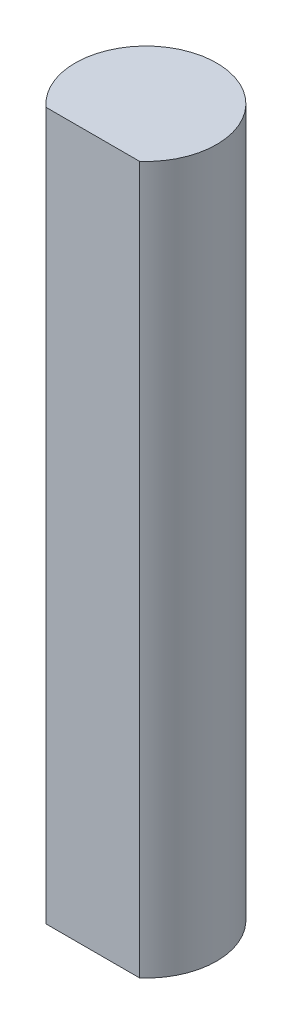
ISO-10303-21;
HEADER;
FILE_DESCRIPTION(('STEP AP214'),'2;1');
FILE_NAME('part.step','',(''),(''),'','','');
FILE_SCHEMA(('AUTOMOTIVE_DESIGN { 1 0 10303 214 1 1 1 1 }'));
ENDSEC;
DATA;
#1=APPLICATION_CONTEXT('core data for automotive mechanical design processes');
#2=APPLICATION_PROTOCOL_DEFINITION('international standard','automotive_design',2000,#1);
#3=PRODUCT_CONTEXT('',#1,'mechanical');
#4=PRODUCT('Part','Part','',(#3));
#5=PRODUCT_RELATED_PRODUCT_CATEGORY('part','',(#4));
#6=PRODUCT_DEFINITION_FORMATION('','',#4);
#7=PRODUCT_DEFINITION_CONTEXT('part definition',#1,'design');
#8=PRODUCT_DEFINITION('design','',#6,#7);
#9=PRODUCT_DEFINITION_SHAPE('','',#8);
#10=(LENGTH_UNIT() NAMED_UNIT(*) SI_UNIT(.MILLI.,.METRE.));
#11=(NAMED_UNIT(*) PLANE_ANGLE_UNIT() SI_UNIT($,.RADIAN.));
#12=(NAMED_UNIT(*) SI_UNIT($,.STERADIAN.) SOLID_ANGLE_UNIT());
#13=UNCERTAINTY_MEASURE_WITH_UNIT(LENGTH_MEASURE(1.E-05),#10,'distance_accuracy_value','');
#14=(GEOMETRIC_REPRESENTATION_CONTEXT(3) GLOBAL_UNCERTAINTY_ASSIGNED_CONTEXT((#13)) GLOBAL_UNIT_ASSIGNED_CONTEXT((#10,
#11,#12)) REPRESENTATION_CONTEXT('',''));
#15=CARTESIAN_POINT('',(0.,0.,0.));
#16=DIRECTION('',(0.,0.,1.));
#17=DIRECTION('',(1.,0.,0.));
#18=AXIS2_PLACEMENT_3D('',#15,#16,#17);
#19=CARTESIAN_POINT('',(0.,40.,3.));
#20=DIRECTION('',(0.,0.,-1.));
#21=DIRECTION('',(-1.,0.,0.));
#22=AXIS2_PLACEMENT_3D('',#19,#20,#21);
#23=PLANE('',#22);
#24=DIRECTION('',(1.,0.,0.));
#25=VECTOR('',#24,1.);
#26=CARTESIAN_POINT('',(0.,0.,3.));
#27=LINE('',#26,#25);
#28=CARTESIAN_POINT('',(-2.64575131106459,0.,3.));
#29=VERTEX_POINT('',#28);
#30=CARTESIAN_POINT('',(2.64575131106459,0.,3.));
#31=VERTEX_POINT('',#30);
#32=EDGE_CURVE('E68',#29,#31,#27,.T.);
#33=ORIENTED_EDGE('',*,*,#32,.T.);
#34=DIRECTION('',(0.,-1.,0.));
#35=VECTOR('',#34,1.);
#36=CARTESIAN_POINT('',(2.64575131106459,40.,3.));
#37=LINE('',#36,#35);
#38=CARTESIAN_POINT('',(2.64575131106459,40.,3.));
#39=VERTEX_POINT('',#38);
#40=EDGE_CURVE('E11',#39,#31,#37,.T.);
#41=ORIENTED_EDGE('',*,*,#40,.F.);
#42=DIRECTION('',(1.,0.,0.));
#43=VECTOR('',#42,1.);
#44=CARTESIAN_POINT('',(0.,40.,3.));
#45=LINE('',#44,#43);
#46=CARTESIAN_POINT('',(-2.64575131106459,40.,3.));
#47=VERTEX_POINT('',#46);
#48=EDGE_CURVE('E67',#47,#39,#45,.T.);
#49=ORIENTED_EDGE('',*,*,#48,.F.);
#50=DIRECTION('',(0.,-1.,0.));
#51=VECTOR('',#50,1.);
#52=CARTESIAN_POINT('',(-2.64575131106459,40.,3.));
#53=LINE('',#52,#51);
#54=EDGE_CURVE('E45',#47,#29,#53,.T.);
#55=ORIENTED_EDGE('',*,*,#54,.T.);
#56=EDGE_LOOP('',(#33,#41,#49,#55));
#57=FACE_BOUND('',#56,.T.);
#58=ADVANCED_FACE('F37',(#57),#23,.F.);
#59=CARTESIAN_POINT('',(0.,40.,0.));
#60=DIRECTION('',(0.,-1.,0.));
#61=DIRECTION('',(0.,0.,-1.));
#62=AXIS2_PLACEMENT_3D('',#59,#60,#61);
#63=CYLINDRICAL_SURFACE('',#62,4.);
#64=CARTESIAN_POINT('',(0.,0.,0.));
#65=DIRECTION('',(0.,1.,0.));
#66=DIRECTION('',(0.,0.,1.));
#67=AXIS2_PLACEMENT_3D('',#64,#65,#66);
#68=CIRCLE('',#67,4.);
#69=EDGE_CURVE('E60',#31,#29,#68,.T.);
#70=ORIENTED_EDGE('',*,*,#69,.T.);
#71=ORIENTED_EDGE('',*,*,#54,.F.);
#72=CARTESIAN_POINT('',(0.,40.,0.));
#73=DIRECTION('',(0.,1.,0.));
#74=DIRECTION('',(0.,0.,1.));
#75=AXIS2_PLACEMENT_3D('',#72,#73,#74);
#76=CIRCLE('',#75,4.);
#77=EDGE_CURVE('E52',#39,#47,#76,.T.);
#78=ORIENTED_EDGE('',*,*,#77,.F.);
#79=ORIENTED_EDGE('',*,*,#40,.T.);
#80=EDGE_LOOP('',(#70,#71,#78,#79));
#81=FACE_BOUND('',#80,.T.);
#82=ADVANCED_FACE('F63',(#81),#63,.T.);
#83=CARTESIAN_POINT('',(0.,40.,0.));
#84=DIRECTION('',(0.,1.,0.));
#85=DIRECTION('',(0.,0.,1.));
#86=AXIS2_PLACEMENT_3D('',#83,#84,#85);
#87=PLANE('',#86);
#88=ORIENTED_EDGE('',*,*,#48,.T.);
#89=ORIENTED_EDGE('',*,*,#77,.T.);
#90=EDGE_LOOP('',(#88,#89));
#91=FACE_BOUND('',#90,.T.);
#92=ADVANCED_FACE('F75',(#91),#87,.T.);
#93=CARTESIAN_POINT('',(0.,0.,0.));
#94=DIRECTION('',(0.,1.,0.));
#95=DIRECTION('',(0.,0.,1.));
#96=AXIS2_PLACEMENT_3D('',#93,#94,#95);
#97=PLANE('',#96);
#98=ORIENTED_EDGE('',*,*,#32,.F.);
#99=ORIENTED_EDGE('',*,*,#69,.F.);
#100=EDGE_LOOP('',(#98,#99));
#101=FACE_BOUND('',#100,.T.);
#102=ADVANCED_FACE('F71',(#101),#97,.F.);
#103=CLOSED_SHELL('',(#58,#82,#92,#102));
#104=MANIFOLD_SOLID_BREP('B2',#103);
#105=ADVANCED_BREP_SHAPE_REPRESENTATION('',(#18,#104),#14);
#106=SHAPE_DEFINITION_REPRESENTATION(#9,#105);
ENDSEC;
END-ISO-10303-21;
